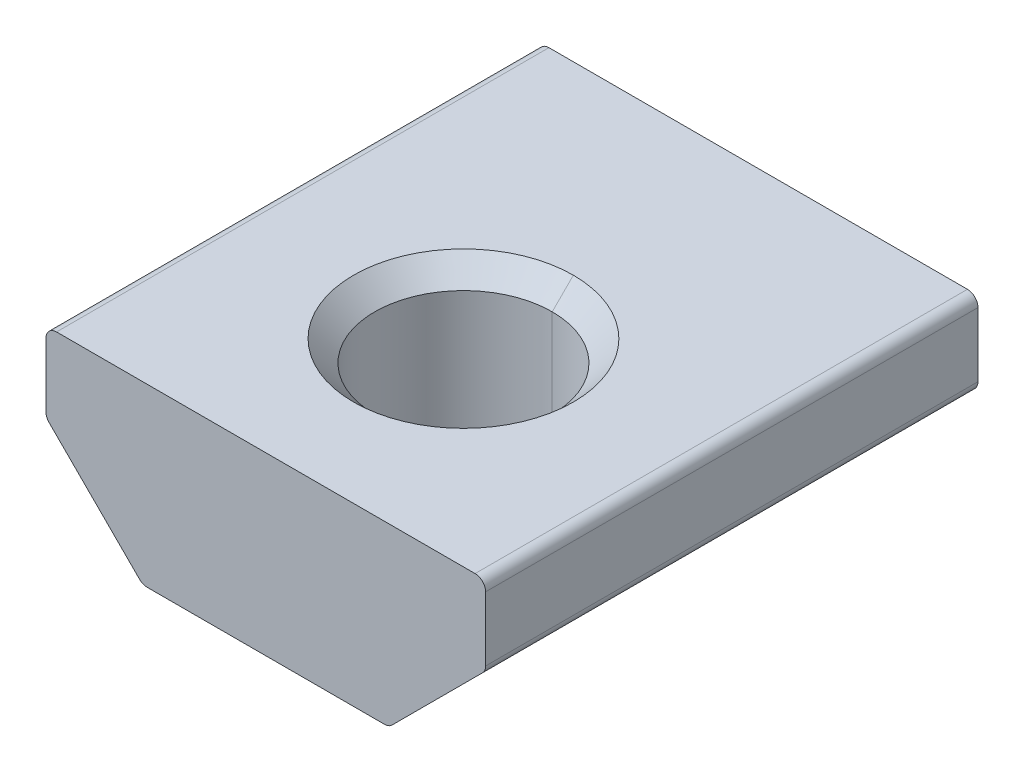
ISO-10303-21;
HEADER;
FILE_DESCRIPTION(('STEP AP214'),'2;1');
FILE_NAME('part.step','',(''),(''),'','','');
FILE_SCHEMA(('AUTOMOTIVE_DESIGN { 1 0 10303 214 1 1 1 1 }'));
ENDSEC;
DATA;
#1=APPLICATION_CONTEXT('core data for automotive mechanical design processes');
#2=APPLICATION_PROTOCOL_DEFINITION('international standard','automotive_design',2000,#1);
#3=PRODUCT_CONTEXT('',#1,'mechanical');
#4=PRODUCT('Part','Part','',(#3));
#5=PRODUCT_RELATED_PRODUCT_CATEGORY('part','',(#4));
#6=PRODUCT_DEFINITION_FORMATION('','',#4);
#7=PRODUCT_DEFINITION_CONTEXT('part definition',#1,'design');
#8=PRODUCT_DEFINITION('design','',#6,#7);
#9=PRODUCT_DEFINITION_SHAPE('','',#8);
#10=(LENGTH_UNIT() NAMED_UNIT(*) SI_UNIT(.MILLI.,.METRE.));
#11=(NAMED_UNIT(*) PLANE_ANGLE_UNIT() SI_UNIT($,.RADIAN.));
#12=(NAMED_UNIT(*) SI_UNIT($,.STERADIAN.) SOLID_ANGLE_UNIT());
#13=UNCERTAINTY_MEASURE_WITH_UNIT(LENGTH_MEASURE(1.E-05),#10,'distance_accuracy_value','');
#14=(GEOMETRIC_REPRESENTATION_CONTEXT(3) GLOBAL_UNCERTAINTY_ASSIGNED_CONTEXT((#13)) GLOBAL_UNIT_ASSIGNED_CONTEXT((#10,
#11,#12)) REPRESENTATION_CONTEXT('',''));
#15=CARTESIAN_POINT('',(0.,0.,0.));
#16=DIRECTION('',(0.,0.,1.));
#17=DIRECTION('',(1.,0.,0.));
#18=AXIS2_PLACEMENT_3D('',#15,#16,#17);
#19=CARTESIAN_POINT('',(-7.55650000000015,5.96900000000015,7.1374));
#20=DIRECTION('',(0.,0.,-1.));
#21=DIRECTION('',(0.707106781186548,-0.707106781186547,0.));
#22=AXIS2_PLACEMENT_3D('',#19,#20,#21);
#23=CYLINDRICAL_SURFACE('',#22,0.380999999999846);
#24=CARTESIAN_POINT('',(-7.55650000000015,5.96900000000015,-10.6426));
#25=DIRECTION('',(0.,0.,1.));
#26=DIRECTION('',(1.,0.,0.));
#27=AXIS2_PLACEMENT_3D('',#24,#25,#26);
#28=CIRCLE('',#27,0.380999999999846);
#29=CARTESIAN_POINT('',(-7.5565,6.35,-10.6426));
#30=VERTEX_POINT('',#29);
#31=CARTESIAN_POINT('',(-7.9375,5.969,-10.6426));
#32=VERTEX_POINT('',#31);
#33=EDGE_CURVE('E11',#30,#32,#28,.T.);
#34=ORIENTED_EDGE('',*,*,#33,.T.);
#35=DIRECTION('',(0.,0.,-1.));
#36=VECTOR('',#35,1.);
#37=CARTESIAN_POINT('',(-7.9375,5.969,7.1374));
#38=LINE('',#37,#36);
#39=CARTESIAN_POINT('',(-7.9375,5.969,7.1374));
#40=VERTEX_POINT('',#39);
#41=EDGE_CURVE('E25',#40,#32,#38,.T.);
#42=ORIENTED_EDGE('',*,*,#41,.F.);
#43=CARTESIAN_POINT('',(-7.55650000000015,5.96900000000015,7.1374));
#44=DIRECTION('',(0.,0.,1.));
#45=DIRECTION('',(1.,0.,0.));
#46=AXIS2_PLACEMENT_3D('',#43,#44,#45);
#47=CIRCLE('',#46,0.380999999999846);
#48=CARTESIAN_POINT('',(-7.5565,6.35,7.1374));
#49=VERTEX_POINT('',#48);
#50=EDGE_CURVE('E374',#49,#40,#47,.T.);
#51=ORIENTED_EDGE('',*,*,#50,.F.);
#52=DIRECTION('',(0.,0.,-1.));
#53=VECTOR('',#52,1.);
#54=CARTESIAN_POINT('',(-7.5565,6.35,7.1374));
#55=LINE('',#54,#53);
#56=EDGE_CURVE('E370',#49,#30,#55,.T.);
#57=ORIENTED_EDGE('',*,*,#56,.T.);
#58=EDGE_LOOP('',(#34,#42,#51,#57));
#59=FACE_BOUND('',#58,.T.);
#60=ADVANCED_FACE('F17',(#59),#23,.T.);
#61=CARTESIAN_POINT('',(7.5565,6.35,7.1374));
#62=DIRECTION('',(0.,-1.,0.));
#63=DIRECTION('',(0.,0.,-1.));
#64=AXIS2_PLACEMENT_3D('',#61,#62,#63);
#65=PLANE('',#64);
#66=CARTESIAN_POINT('',(0.,6.35,0.));
#67=DIRECTION('',(0.,-1.,0.));
#68=DIRECTION('',(0.,0.,-1.));
#69=AXIS2_PLACEMENT_3D('',#66,#67,#68);
#70=CIRCLE('',#69,3.96875);
#71=CARTESIAN_POINT('',(0.,6.35,-3.96875));
#72=VERTEX_POINT('',#71);
#73=CARTESIAN_POINT('',(0.,6.35,3.96875));
#74=VERTEX_POINT('',#73);
#75=EDGE_CURVE('E161',#72,#74,#70,.T.);
#76=ORIENTED_EDGE('',*,*,#75,.T.);
#77=CARTESIAN_POINT('',(0.,6.35,0.));
#78=DIRECTION('',(0.,-1.,0.));
#79=DIRECTION('',(0.,0.,-1.));
#80=AXIS2_PLACEMENT_3D('',#77,#78,#79);
#81=CIRCLE('',#80,3.96875);
#82=EDGE_CURVE('E363',#74,#72,#81,.T.);
#83=ORIENTED_EDGE('',*,*,#82,.T.);
#84=EDGE_LOOP('',(#76,#83));
#85=FACE_BOUND('',#84,.T.);
#86=DIRECTION('',(-1.,0.,0.));
#87=VECTOR('',#86,1.);
#88=CARTESIAN_POINT('',(7.5565,6.35,-10.6426));
#89=LINE('',#88,#87);
#90=CARTESIAN_POINT('',(7.5565,6.35,-10.6426));
#91=VERTEX_POINT('',#90);
#92=EDGE_CURVE('E358',#91,#30,#89,.T.);
#93=ORIENTED_EDGE('',*,*,#92,.T.);
#94=ORIENTED_EDGE('',*,*,#56,.F.);
#95=DIRECTION('',(-1.,0.,0.));
#96=VECTOR('',#95,1.);
#97=CARTESIAN_POINT('',(7.5565,6.35,7.1374));
#98=LINE('',#97,#96);
#99=CARTESIAN_POINT('',(7.5565,6.35,7.1374));
#100=VERTEX_POINT('',#99);
#101=EDGE_CURVE('E353',#100,#49,#98,.T.);
#102=ORIENTED_EDGE('',*,*,#101,.F.);
#103=DIRECTION('',(0.,0.,-1.));
#104=VECTOR('',#103,1.);
#105=CARTESIAN_POINT('',(7.5565,6.35,7.1374));
#106=LINE('',#105,#104);
#107=EDGE_CURVE('E349',#100,#91,#106,.T.);
#108=ORIENTED_EDGE('',*,*,#107,.T.);
#109=EDGE_LOOP('',(#93,#94,#102,#108));
#110=FACE_BOUND('',#109,.T.);
#111=ADVANCED_FACE('F391',(#85,#110),#65,.F.);
#112=CARTESIAN_POINT('',(7.55650000000015,5.96900000000015,7.1374));
#113=DIRECTION('',(0.,0.,-1.));
#114=DIRECTION('',(-0.707106781186547,-0.707106781186548,0.));
#115=AXIS2_PLACEMENT_3D('',#112,#113,#114);
#116=CYLINDRICAL_SURFACE('',#115,0.380999999999847);
#117=CARTESIAN_POINT('',(7.55650000000015,5.96900000000015,-10.6426));
#118=DIRECTION('',(0.,0.,1.));
#119=DIRECTION('',(1.,0.,0.));
#120=AXIS2_PLACEMENT_3D('',#117,#118,#119);
#121=CIRCLE('',#120,0.380999999999847);
#122=CARTESIAN_POINT('',(7.9375,5.969,-10.6426));
#123=VERTEX_POINT('',#122);
#124=EDGE_CURVE('E344',#123,#91,#121,.T.);
#125=ORIENTED_EDGE('',*,*,#124,.T.);
#126=ORIENTED_EDGE('',*,*,#107,.F.);
#127=CARTESIAN_POINT('',(7.55650000000015,5.96900000000015,7.1374));
#128=DIRECTION('',(0.,0.,1.));
#129=DIRECTION('',(1.,0.,0.));
#130=AXIS2_PLACEMENT_3D('',#127,#128,#129);
#131=CIRCLE('',#130,0.380999999999847);
#132=CARTESIAN_POINT('',(7.9375,5.969,7.1374));
#133=VERTEX_POINT('',#132);
#134=EDGE_CURVE('E339',#133,#100,#131,.T.);
#135=ORIENTED_EDGE('',*,*,#134,.F.);
#136=DIRECTION('',(0.,0.,-1.));
#137=VECTOR('',#136,1.);
#138=CARTESIAN_POINT('',(7.9375,5.969,7.1374));
#139=LINE('',#138,#137);
#140=EDGE_CURVE('E335',#133,#123,#139,.T.);
#141=ORIENTED_EDGE('',*,*,#140,.T.);
#142=EDGE_LOOP('',(#125,#126,#135,#141));
#143=FACE_BOUND('',#142,.T.);
#144=ADVANCED_FACE('F429',(#143),#116,.T.);
#145=CARTESIAN_POINT('',(7.9375,3.65031536726424,7.1374));
#146=DIRECTION('',(-1.,0.,0.));
#147=DIRECTION('',(0.,0.,1.));
#148=AXIS2_PLACEMENT_3D('',#145,#146,#147);
#149=PLANE('',#148);
#150=DIRECTION('',(0.,1.,0.));
#151=VECTOR('',#150,1.);
#152=CARTESIAN_POINT('',(7.9375,3.65031536726424,-10.6426));
#153=LINE('',#152,#151);
#154=CARTESIAN_POINT('',(7.9375,3.65031536726424,-10.6426));
#155=VERTEX_POINT('',#154);
#156=EDGE_CURVE('E330',#155,#123,#153,.T.);
#157=ORIENTED_EDGE('',*,*,#156,.T.);
#158=ORIENTED_EDGE('',*,*,#140,.F.);
#159=DIRECTION('',(0.,1.,0.));
#160=VECTOR('',#159,1.);
#161=CARTESIAN_POINT('',(7.9375,3.65031536726424,7.1374));
#162=LINE('',#161,#160);
#163=CARTESIAN_POINT('',(7.9375,3.65031536726424,7.1374));
#164=VERTEX_POINT('',#163);
#165=EDGE_CURVE('E325',#164,#133,#162,.T.);
#166=ORIENTED_EDGE('',*,*,#165,.F.);
#167=DIRECTION('',(0.,0.,-1.));
#168=VECTOR('',#167,1.);
#169=CARTESIAN_POINT('',(7.9375,3.65031536726424,7.1374));
#170=LINE('',#169,#168);
#171=EDGE_CURVE('E321',#164,#155,#170,.T.);
#172=ORIENTED_EDGE('',*,*,#171,.T.);
#173=EDGE_LOOP('',(#157,#158,#166,#172));
#174=FACE_BOUND('',#173,.T.);
#175=ADVANCED_FACE('F427',(#174),#149,.F.);
#176=CARTESIAN_POINT('',(7.5565000000002,3.65031536726407,7.1374));
#177=DIRECTION('',(0.,0.,-1.));
#178=DIRECTION('',(-0.923879532511361,0.38268343236491,0.));
#179=AXIS2_PLACEMENT_3D('',#176,#177,#178);
#180=CYLINDRICAL_SURFACE('',#179,0.380999999999805);
#181=CARTESIAN_POINT('',(7.5565000000002,3.65031536726407,-10.6426));
#182=DIRECTION('',(0.,0.,1.));
#183=DIRECTION('',(1.,0.,0.));
#184=AXIS2_PLACEMENT_3D('',#181,#182,#183);
#185=CIRCLE('',#184,0.380999999999805);
#186=CARTESIAN_POINT('',(7.82590768363212,3.38090768363212,-10.6426));
#187=VERTEX_POINT('',#186);
#188=EDGE_CURVE('E316',#187,#155,#185,.T.);
#189=ORIENTED_EDGE('',*,*,#188,.T.);
#190=ORIENTED_EDGE('',*,*,#171,.F.);
#191=CARTESIAN_POINT('',(7.5565000000002,3.65031536726407,7.1374));
#192=DIRECTION('',(0.,0.,1.));
#193=DIRECTION('',(1.,0.,0.));
#194=AXIS2_PLACEMENT_3D('',#191,#192,#193);
#195=CIRCLE('',#194,0.380999999999805);
#196=CARTESIAN_POINT('',(7.82590768363212,3.38090768363212,7.1374));
#197=VERTEX_POINT('',#196);
#198=EDGE_CURVE('E311',#197,#164,#195,.T.);
#199=ORIENTED_EDGE('',*,*,#198,.F.);
#200=DIRECTION('',(0.,0.,-1.));
#201=VECTOR('',#200,1.);
#202=CARTESIAN_POINT('',(7.82590768363212,3.38090768363212,7.1374));
#203=LINE('',#202,#201);
#204=EDGE_CURVE('E307',#197,#187,#203,.T.);
#205=ORIENTED_EDGE('',*,*,#204,.T.);
#206=EDGE_LOOP('',(#189,#190,#199,#205));
#207=FACE_BOUND('',#206,.T.);
#208=ADVANCED_FACE('F422',(#207),#180,.T.);
#209=CARTESIAN_POINT('',(4.55659231636788,0.111592316367926,7.1374));
#210=DIRECTION('',(-0.707106781186543,0.707106781186553,0.));
#211=DIRECTION('',(-0.707106781186553,-0.707106781186543,0.));
#212=AXIS2_PLACEMENT_3D('',#209,#210,#211);
#213=PLANE('',#212);
#214=DIRECTION('',(0.707106781186553,0.707106781186543,0.));
#215=VECTOR('',#214,1.);
#216=CARTESIAN_POINT('',(4.55659231636788,0.111592316367926,-10.6426));
#217=LINE('',#216,#215);
#218=CARTESIAN_POINT('',(4.55659231636788,0.111592316367925,-10.6426));
#219=VERTEX_POINT('',#218);
#220=EDGE_CURVE('E302',#219,#187,#217,.T.);
#221=ORIENTED_EDGE('',*,*,#220,.T.);
#222=ORIENTED_EDGE('',*,*,#204,.F.);
#223=DIRECTION('',(0.707106781186553,0.707106781186543,0.));
#224=VECTOR('',#223,1.);
#225=CARTESIAN_POINT('',(4.55659231636788,0.111592316367926,7.1374));
#226=LINE('',#225,#224);
#227=CARTESIAN_POINT('',(4.55659231636788,0.111592316367925,7.1374));
#228=VERTEX_POINT('',#227);
#229=EDGE_CURVE('E297',#228,#197,#226,.T.);
#230=ORIENTED_EDGE('',*,*,#229,.F.);
#231=DIRECTION('',(0.,0.,-1.));
#232=VECTOR('',#231,1.);
#233=CARTESIAN_POINT('',(4.55659231636788,0.111592316367925,7.1374));
#234=LINE('',#233,#232);
#235=EDGE_CURVE('E293',#228,#219,#234,.T.);
#236=ORIENTED_EDGE('',*,*,#235,.T.);
#237=EDGE_LOOP('',(#221,#222,#230,#236));
#238=FACE_BOUND('',#237,.T.);
#239=ADVANCED_FACE('F419',(#238),#213,.F.);
#240=CARTESIAN_POINT('',(4.2871846327359,0.380999999999779,7.1374));
#241=DIRECTION('',(0.,0.,-1.));
#242=DIRECTION('',(-0.382683432365037,0.923879532511309,0.));
#243=AXIS2_PLACEMENT_3D('',#240,#241,#242);
#244=CYLINDRICAL_SURFACE('',#243,0.380999999999779);
#245=CARTESIAN_POINT('',(4.2871846327359,0.380999999999779,-10.6426));
#246=DIRECTION('',(0.,0.,1.));
#247=DIRECTION('',(1.,0.,0.));
#248=AXIS2_PLACEMENT_3D('',#245,#246,#247);
#249=CIRCLE('',#248,0.380999999999779);
#250=CARTESIAN_POINT('',(4.28718463273576,0.,-10.6426));
#251=VERTEX_POINT('',#250);
#252=EDGE_CURVE('E288',#251,#219,#249,.T.);
#253=ORIENTED_EDGE('',*,*,#252,.T.);
#254=ORIENTED_EDGE('',*,*,#235,.F.);
#255=CARTESIAN_POINT('',(4.2871846327359,0.380999999999779,7.1374));
#256=DIRECTION('',(0.,0.,1.));
#257=DIRECTION('',(1.,0.,0.));
#258=AXIS2_PLACEMENT_3D('',#255,#256,#257);
#259=CIRCLE('',#258,0.380999999999779);
#260=CARTESIAN_POINT('',(4.28718463273576,0.,7.1374));
#261=VERTEX_POINT('',#260);
#262=EDGE_CURVE('E283',#261,#228,#259,.T.);
#263=ORIENTED_EDGE('',*,*,#262,.F.);
#264=DIRECTION('',(0.,0.,-1.));
#265=VECTOR('',#264,1.);
#266=CARTESIAN_POINT('',(4.28718463273576,0.,7.1374));
#267=LINE('',#266,#265);
#268=EDGE_CURVE('E279',#261,#251,#267,.T.);
#269=ORIENTED_EDGE('',*,*,#268,.T.);
#270=EDGE_LOOP('',(#253,#254,#263,#269));
#271=FACE_BOUND('',#270,.T.);
#272=ADVANCED_FACE('F416',(#271),#244,.T.);
#273=CARTESIAN_POINT('',(-4.28718463273576,0.,7.1374));
#274=DIRECTION('',(0.,1.,0.));
#275=DIRECTION('',(0.,0.,1.));
#276=AXIS2_PLACEMENT_3D('',#273,#274,#275);
#277=PLANE('',#276);
#278=CARTESIAN_POINT('',(0.,0.,0.));
#279=DIRECTION('',(0.,-1.,0.));
#280=DIRECTION('',(0.,0.,-1.));
#281=AXIS2_PLACEMENT_3D('',#278,#279,#280);
#282=CIRCLE('',#281,3.96875);
#283=CARTESIAN_POINT('',(0.,0.,3.96875));
#284=VERTEX_POINT('',#283);
#285=CARTESIAN_POINT('',(0.,0.,-3.96875));
#286=VERTEX_POINT('',#285);
#287=EDGE_CURVE('E274',#284,#286,#282,.T.);
#288=ORIENTED_EDGE('',*,*,#287,.F.);
#289=CARTESIAN_POINT('',(0.,0.,0.));
#290=DIRECTION('',(0.,-1.,0.));
#291=DIRECTION('',(0.,0.,-1.));
#292=AXIS2_PLACEMENT_3D('',#289,#290,#291);
#293=CIRCLE('',#292,3.96875);
#294=EDGE_CURVE('E269',#286,#284,#293,.T.);
#295=ORIENTED_EDGE('',*,*,#294,.F.);
#296=EDGE_LOOP('',(#288,#295));
#297=FACE_BOUND('',#296,.T.);
#298=DIRECTION('',(1.,0.,0.));
#299=VECTOR('',#298,1.);
#300=CARTESIAN_POINT('',(-4.28718463273576,0.,-10.6426));
#301=LINE('',#300,#299);
#302=CARTESIAN_POINT('',(-4.28718463273576,0.,-10.6426));
#303=VERTEX_POINT('',#302);
#304=EDGE_CURVE('E264',#303,#251,#301,.T.);
#305=ORIENTED_EDGE('',*,*,#304,.T.);
#306=ORIENTED_EDGE('',*,*,#268,.F.);
#307=DIRECTION('',(1.,0.,0.));
#308=VECTOR('',#307,1.);
#309=CARTESIAN_POINT('',(-4.28718463273576,0.,7.1374));
#310=LINE('',#309,#308);
#311=CARTESIAN_POINT('',(-4.28718463273576,0.,7.1374));
#312=VERTEX_POINT('',#311);
#313=EDGE_CURVE('E259',#312,#261,#310,.T.);
#314=ORIENTED_EDGE('',*,*,#313,.F.);
#315=DIRECTION('',(0.,0.,-1.));
#316=VECTOR('',#315,1.);
#317=CARTESIAN_POINT('',(-4.28718463273576,0.,7.1374));
#318=LINE('',#317,#316);
#319=EDGE_CURVE('E255',#312,#303,#318,.T.);
#320=ORIENTED_EDGE('',*,*,#319,.T.);
#321=EDGE_LOOP('',(#305,#306,#314,#320));
#322=FACE_BOUND('',#321,.T.);
#323=ADVANCED_FACE('F410',(#297,#322),#277,.F.);
#324=CARTESIAN_POINT('',(-4.2871846327359,0.380999999999779,7.1374));
#325=DIRECTION('',(0.,0.,-1.));
#326=DIRECTION('',(0.382683432365037,0.923879532511309,0.));
#327=AXIS2_PLACEMENT_3D('',#324,#325,#326);
#328=CYLINDRICAL_SURFACE('',#327,0.380999999999779);
#329=CARTESIAN_POINT('',(-4.2871846327359,0.380999999999779,-10.6426));
#330=DIRECTION('',(0.,0.,1.));
#331=DIRECTION('',(1.,0.,0.));
#332=AXIS2_PLACEMENT_3D('',#329,#330,#331);
#333=CIRCLE('',#332,0.380999999999779);
#334=CARTESIAN_POINT('',(-4.55659231636788,0.111592316367926,-10.6426));
#335=VERTEX_POINT('',#334);
#336=EDGE_CURVE('E250',#335,#303,#333,.T.);
#337=ORIENTED_EDGE('',*,*,#336,.T.);
#338=ORIENTED_EDGE('',*,*,#319,.F.);
#339=CARTESIAN_POINT('',(-4.2871846327359,0.380999999999779,7.1374));
#340=DIRECTION('',(0.,0.,1.));
#341=DIRECTION('',(1.,0.,0.));
#342=AXIS2_PLACEMENT_3D('',#339,#340,#341);
#343=CIRCLE('',#342,0.380999999999779);
#344=CARTESIAN_POINT('',(-4.55659231636788,0.111592316367926,7.1374));
#345=VERTEX_POINT('',#344);
#346=EDGE_CURVE('E245',#345,#312,#343,.T.);
#347=ORIENTED_EDGE('',*,*,#346,.F.);
#348=DIRECTION('',(0.,0.,-1.));
#349=VECTOR('',#348,1.);
#350=CARTESIAN_POINT('',(-4.55659231636788,0.111592316367926,7.1374));
#351=LINE('',#350,#349);
#352=EDGE_CURVE('E241',#345,#335,#351,.T.);
#353=ORIENTED_EDGE('',*,*,#352,.T.);
#354=EDGE_LOOP('',(#337,#338,#347,#353));
#355=FACE_BOUND('',#354,.T.);
#356=ADVANCED_FACE('F407',(#355),#328,.T.);
#357=CARTESIAN_POINT('',(-7.82590768363212,3.38090768363212,7.1374));
#358=DIRECTION('',(0.707106781186543,0.707106781186553,0.));
#359=DIRECTION('',(-0.707106781186553,0.707106781186543,0.));
#360=AXIS2_PLACEMENT_3D('',#357,#358,#359);
#361=PLANE('',#360);
#362=DIRECTION('',(0.707106781186553,-0.707106781186543,0.));
#363=VECTOR('',#362,1.);
#364=CARTESIAN_POINT('',(-7.82590768363212,3.38090768363212,-10.6426));
#365=LINE('',#364,#363);
#366=CARTESIAN_POINT('',(-7.82590768363212,3.38090768363212,-10.6426));
#367=VERTEX_POINT('',#366);
#368=EDGE_CURVE('E236',#367,#335,#365,.T.);
#369=ORIENTED_EDGE('',*,*,#368,.T.);
#370=ORIENTED_EDGE('',*,*,#352,.F.);
#371=DIRECTION('',(0.707106781186553,-0.707106781186543,0.));
#372=VECTOR('',#371,1.);
#373=CARTESIAN_POINT('',(-7.82590768363212,3.38090768363212,7.1374));
#374=LINE('',#373,#372);
#375=CARTESIAN_POINT('',(-7.82590768363212,3.38090768363212,7.1374));
#376=VERTEX_POINT('',#375);
#377=EDGE_CURVE('E231',#376,#345,#374,.T.);
#378=ORIENTED_EDGE('',*,*,#377,.F.);
#379=DIRECTION('',(0.,0.,-1.));
#380=VECTOR('',#379,1.);
#381=CARTESIAN_POINT('',(-7.82590768363212,3.38090768363212,7.1374));
#382=LINE('',#381,#380);
#383=EDGE_CURVE('E227',#376,#367,#382,.T.);
#384=ORIENTED_EDGE('',*,*,#383,.T.);
#385=EDGE_LOOP('',(#369,#370,#378,#384));
#386=FACE_BOUND('',#385,.T.);
#387=ADVANCED_FACE('F405',(#386),#361,.F.);
#388=CARTESIAN_POINT('',(-7.5565000000002,3.65031536726407,7.1374));
#389=DIRECTION('',(0.,0.,-1.));
#390=DIRECTION('',(0.923879532511361,0.382683432364911,0.));
#391=AXIS2_PLACEMENT_3D('',#388,#389,#390);
#392=CYLINDRICAL_SURFACE('',#391,0.380999999999805);
#393=CARTESIAN_POINT('',(-7.5565000000002,3.65031536726407,-10.6426));
#394=DIRECTION('',(0.,0.,1.));
#395=DIRECTION('',(1.,0.,0.));
#396=AXIS2_PLACEMENT_3D('',#393,#394,#395);
#397=CIRCLE('',#396,0.380999999999805);
#398=CARTESIAN_POINT('',(-7.9375,3.65031536726424,-10.6426));
#399=VERTEX_POINT('',#398);
#400=EDGE_CURVE('E222',#399,#367,#397,.T.);
#401=ORIENTED_EDGE('',*,*,#400,.T.);
#402=ORIENTED_EDGE('',*,*,#383,.F.);
#403=CARTESIAN_POINT('',(-7.5565000000002,3.65031536726407,7.1374));
#404=DIRECTION('',(0.,0.,1.));
#405=DIRECTION('',(1.,0.,0.));
#406=AXIS2_PLACEMENT_3D('',#403,#404,#405);
#407=CIRCLE('',#406,0.380999999999805);
#408=CARTESIAN_POINT('',(-7.9375,3.65031536726424,7.1374));
#409=VERTEX_POINT('',#408);
#410=EDGE_CURVE('E217',#409,#376,#407,.T.);
#411=ORIENTED_EDGE('',*,*,#410,.F.);
#412=DIRECTION('',(0.,0.,-1.));
#413=VECTOR('',#412,1.);
#414=CARTESIAN_POINT('',(-7.9375,3.65031536726424,7.1374));
#415=LINE('',#414,#413);
#416=EDGE_CURVE('E213',#409,#399,#415,.T.);
#417=ORIENTED_EDGE('',*,*,#416,.T.);
#418=EDGE_LOOP('',(#401,#402,#411,#417));
#419=FACE_BOUND('',#418,.T.);
#420=ADVANCED_FACE('F401',(#419),#392,.T.);
#421=CARTESIAN_POINT('',(-7.9375,5.969,7.1374));
#422=DIRECTION('',(1.,0.,0.));
#423=DIRECTION('',(0.,0.,-1.));
#424=AXIS2_PLACEMENT_3D('',#421,#422,#423);
#425=PLANE('',#424);
#426=DIRECTION('',(0.,-1.,0.));
#427=VECTOR('',#426,1.);
#428=CARTESIAN_POINT('',(-7.9375,5.969,-10.6426));
#429=LINE('',#428,#427);
#430=EDGE_CURVE('E208',#32,#399,#429,.T.);
#431=ORIENTED_EDGE('',*,*,#430,.T.);
#432=ORIENTED_EDGE('',*,*,#416,.F.);
#433=DIRECTION('',(0.,-1.,0.));
#434=VECTOR('',#433,1.);
#435=CARTESIAN_POINT('',(-7.9375,5.969,7.1374));
#436=LINE('',#435,#434);
#437=EDGE_CURVE('E203',#40,#409,#436,.T.);
#438=ORIENTED_EDGE('',*,*,#437,.F.);
#439=ORIENTED_EDGE('',*,*,#41,.T.);
#440=EDGE_LOOP('',(#431,#432,#438,#439));
#441=FACE_BOUND('',#440,.T.);
#442=ADVANCED_FACE('F384',(#441),#425,.F.);
#443=CARTESIAN_POINT('',(-7.55650000000015,5.96900000000015,7.1374));
#444=DIRECTION('',(0.,0.,1.));
#445=DIRECTION('',(1.,0.,0.));
#446=AXIS2_PLACEMENT_3D('',#443,#444,#445);
#447=PLANE('',#446);
#448=ORIENTED_EDGE('',*,*,#50,.T.);
#449=ORIENTED_EDGE('',*,*,#437,.T.);
#450=ORIENTED_EDGE('',*,*,#410,.T.);
#451=ORIENTED_EDGE('',*,*,#377,.T.);
#452=ORIENTED_EDGE('',*,*,#346,.T.);
#453=ORIENTED_EDGE('',*,*,#313,.T.);
#454=ORIENTED_EDGE('',*,*,#262,.T.);
#455=ORIENTED_EDGE('',*,*,#229,.T.);
#456=ORIENTED_EDGE('',*,*,#198,.T.);
#457=ORIENTED_EDGE('',*,*,#165,.T.);
#458=ORIENTED_EDGE('',*,*,#134,.T.);
#459=ORIENTED_EDGE('',*,*,#101,.T.);
#460=EDGE_LOOP('',(#448,#449,#450,#451,#452,#453,#454,#455,#456,#457,#458,#459));
#461=FACE_BOUND('',#460,.T.);
#462=ADVANCED_FACE('F388',(#461),#447,.T.);
#463=CARTESIAN_POINT('',(-7.55650000000015,5.96900000000015,-10.6426));
#464=DIRECTION('',(0.,0.,1.));
#465=DIRECTION('',(1.,0.,0.));
#466=AXIS2_PLACEMENT_3D('',#463,#464,#465);
#467=PLANE('',#466);
#468=ORIENTED_EDGE('',*,*,#33,.F.);
#469=ORIENTED_EDGE('',*,*,#92,.F.);
#470=ORIENTED_EDGE('',*,*,#124,.F.);
#471=ORIENTED_EDGE('',*,*,#156,.F.);
#472=ORIENTED_EDGE('',*,*,#188,.F.);
#473=ORIENTED_EDGE('',*,*,#220,.F.);
#474=ORIENTED_EDGE('',*,*,#252,.F.);
#475=ORIENTED_EDGE('',*,*,#304,.F.);
#476=ORIENTED_EDGE('',*,*,#336,.F.);
#477=ORIENTED_EDGE('',*,*,#368,.F.);
#478=ORIENTED_EDGE('',*,*,#400,.F.);
#479=ORIENTED_EDGE('',*,*,#430,.F.);
#480=EDGE_LOOP('',(#468,#469,#470,#471,#472,#473,#474,#475,#476,#477,#478,#479));
#481=FACE_BOUND('',#480,.T.);
#482=ADVANCED_FACE('F396',(#481),#467,.F.);
#483=CARTESIAN_POINT('',(0.,0.76327,0.));
#484=DIRECTION('',(0.,-1.,0.));
#485=DIRECTION('',(-1.,0.,0.));
#486=AXIS2_PLACEMENT_3D('',#483,#484,#485);
#487=CONICAL_SURFACE('',#486,3.20548,0.785398163397448);
#488=DIRECTION('',(0.,-0.707106781186547,0.707106781186548));
#489=VECTOR('',#488,1.);
#490=CARTESIAN_POINT('',(0.,0.76327,3.20548));
#491=LINE('',#490,#489);
#492=CARTESIAN_POINT('',(0.,0.76327,3.20548));
#493=VERTEX_POINT('',#492);
#494=EDGE_CURVE('E198',#493,#284,#491,.T.);
#495=ORIENTED_EDGE('',*,*,#494,.F.);
#496=CARTESIAN_POINT('',(0.,0.76327,0.));
#497=DIRECTION('',(0.,-1.,0.));
#498=DIRECTION('',(0.,0.,-1.));
#499=AXIS2_PLACEMENT_3D('',#496,#497,#498);
#500=CIRCLE('',#499,3.20548);
#501=CARTESIAN_POINT('',(0.,0.76327,-3.20548));
#502=VERTEX_POINT('',#501);
#503=EDGE_CURVE('E194',#502,#493,#500,.T.);
#504=ORIENTED_EDGE('',*,*,#503,.F.);
#505=DIRECTION('',(0.,-0.707106781186547,-0.707106781186548));
#506=VECTOR('',#505,1.);
#507=CARTESIAN_POINT('',(0.,0.76327,-3.20548));
#508=LINE('',#507,#506);
#509=EDGE_CURVE('E189',#502,#286,#508,.T.);
#510=ORIENTED_EDGE('',*,*,#509,.T.);
#511=ORIENTED_EDGE('',*,*,#294,.T.);
#512=EDGE_LOOP('',(#495,#504,#510,#511));
#513=FACE_BOUND('',#512,.T.);
#514=ADVANCED_FACE('F555',(#513),#487,.F.);
#515=CARTESIAN_POINT('',(0.,0.76327,0.));
#516=DIRECTION('',(0.,-1.,0.));
#517=DIRECTION('',(1.,0.,0.));
#518=AXIS2_PLACEMENT_3D('',#515,#516,#517);
#519=CONICAL_SURFACE('',#518,3.20548,0.785398163397448);
#520=ORIENTED_EDGE('',*,*,#494,.T.);
#521=ORIENTED_EDGE('',*,*,#287,.T.);
#522=ORIENTED_EDGE('',*,*,#509,.F.);
#523=CARTESIAN_POINT('',(0.,0.76327,0.));
#524=DIRECTION('',(0.,-1.,0.));
#525=DIRECTION('',(0.,0.,-1.));
#526=AXIS2_PLACEMENT_3D('',#523,#524,#525);
#527=CIRCLE('',#526,3.20548);
#528=CARTESIAN_POINT('',(-0.990547795129006,0.76327,3.04859264185379));
#529=VERTEX_POINT('',#528);
#530=EDGE_CURVE('E151',#529,#502,#527,.T.);
#531=ORIENTED_EDGE('',*,*,#530,.F.);
#532=CARTESIAN_POINT('',(0.,0.76327,0.));
#533=DIRECTION('',(0.,-1.,0.));
#534=DIRECTION('',(0.,0.,-1.));
#535=AXIS2_PLACEMENT_3D('',#532,#533,#534);
#536=CIRCLE('',#535,3.20548);
#537=EDGE_CURVE('E181',#493,#529,#536,.T.);
#538=ORIENTED_EDGE('',*,*,#537,.F.);
#539=EDGE_LOOP('',(#520,#521,#522,#531,#538));
#540=FACE_BOUND('',#539,.T.);
#541=ADVANCED_FACE('F565',(#540),#519,.F.);
#542=CARTESIAN_POINT('',(0.,0.,0.));
#543=DIRECTION('',(0.,-1.,0.));
#544=DIRECTION('',(-0.987688340595138,0.,-0.156434465040231));
#545=AXIS2_PLACEMENT_3D('',#542,#543,#544);
#546=CYLINDRICAL_SURFACE('',#545,3.20548);
#547=DIRECTION('',(0.,-1.,0.));
#548=VECTOR('',#547,1.);
#549=CARTESIAN_POINT('',(-0.990547795129006,5.58673,3.04859264185379));
#550=LINE('',#549,#548);
#551=CARTESIAN_POINT('',(-0.990547795129006,5.58673,3.04859264185379));
#552=VERTEX_POINT('',#551);
#553=EDGE_CURVE('E177',#552,#529,#550,.T.);
#554=ORIENTED_EDGE('',*,*,#553,.F.);
#555=CARTESIAN_POINT('',(0.,5.58673,0.));
#556=DIRECTION('',(0.,-1.,0.));
#557=DIRECTION('',(0.,0.,-1.));
#558=AXIS2_PLACEMENT_3D('',#555,#556,#557);
#559=CIRCLE('',#558,3.20548);
#560=CARTESIAN_POINT('',(0.,5.58673,3.20548));
#561=VERTEX_POINT('',#560);
#562=EDGE_CURVE('E138',#561,#552,#559,.T.);
#563=ORIENTED_EDGE('',*,*,#562,.F.);
#564=CARTESIAN_POINT('',(0.,5.58673,0.));
#565=DIRECTION('',(0.,-1.,0.));
#566=DIRECTION('',(0.,0.,-1.));
#567=AXIS2_PLACEMENT_3D('',#564,#565,#566);
#568=CIRCLE('',#567,3.20548);
#569=CARTESIAN_POINT('',(0.,5.58673,-3.20548));
#570=VERTEX_POINT('',#569);
#571=EDGE_CURVE('E132',#570,#561,#568,.T.);
#572=ORIENTED_EDGE('',*,*,#571,.F.);
#573=DIRECTION('',(0.,-1.,0.));
#574=VECTOR('',#573,1.);
#575=CARTESIAN_POINT('',(0.,5.58673,-3.20548));
#576=LINE('',#575,#574);
#577=EDGE_CURVE('E136',#570,#502,#576,.T.);
#578=ORIENTED_EDGE('',*,*,#577,.T.);
#579=ORIENTED_EDGE('',*,*,#503,.T.);
#580=ORIENTED_EDGE('',*,*,#537,.T.);
#581=EDGE_LOOP('',(#554,#563,#572,#578,#579,#580));
#582=FACE_BOUND('',#581,.T.);
#583=ADVANCED_FACE('F134',(#582),#546,.F.);
#584=CARTESIAN_POINT('',(0.,0.,0.));
#585=DIRECTION('',(0.,-1.,0.));
#586=DIRECTION('',(0.987688340595138,0.,0.156434465040231));
#587=AXIS2_PLACEMENT_3D('',#584,#585,#586);
#588=CYLINDRICAL_SURFACE('',#587,3.20548);
#589=ORIENTED_EDGE('',*,*,#553,.T.);
#590=ORIENTED_EDGE('',*,*,#530,.T.);
#591=ORIENTED_EDGE('',*,*,#577,.F.);
#592=CARTESIAN_POINT('',(0.,5.58673,0.));
#593=DIRECTION('',(0.,-1.,0.));
#594=DIRECTION('',(0.,0.,-1.));
#595=AXIS2_PLACEMENT_3D('',#592,#593,#594);
#596=CIRCLE('',#595,3.20548);
#597=EDGE_CURVE('E150',#552,#570,#596,.T.);
#598=ORIENTED_EDGE('',*,*,#597,.F.);
#599=EDGE_LOOP('',(#589,#590,#591,#598));
#600=FACE_BOUND('',#599,.T.);
#601=ADVANCED_FACE('F149',(#600),#588,.F.);
#602=CARTESIAN_POINT('',(0.,6.35,0.));
#603=DIRECTION('',(0.,1.,0.));
#604=DIRECTION('',(1.,0.,0.));
#605=AXIS2_PLACEMENT_3D('',#602,#603,#604);
#606=CONICAL_SURFACE('',#605,3.96875,0.785398163397448);
#607=DIRECTION('',(0.,0.707106781186548,-0.707106781186548));
#608=VECTOR('',#607,1.);
#609=CARTESIAN_POINT('',(0.,5.58673,-3.20548));
#610=LINE('',#609,#608);
#611=EDGE_CURVE('E157',#570,#72,#610,.T.);
#612=ORIENTED_EDGE('',*,*,#611,.T.);
#613=ORIENTED_EDGE('',*,*,#82,.F.);
#614=DIRECTION('',(0.,0.707106781186548,0.707106781186548));
#615=VECTOR('',#614,1.);
#616=CARTESIAN_POINT('',(0.,5.58673,3.20548));
#617=LINE('',#616,#615);
#618=EDGE_CURVE('E162',#561,#74,#617,.T.);
#619=ORIENTED_EDGE('',*,*,#618,.F.);
#620=ORIENTED_EDGE('',*,*,#562,.T.);
#621=ORIENTED_EDGE('',*,*,#597,.T.);
#622=EDGE_LOOP('',(#612,#613,#619,#620,#621));
#623=FACE_BOUND('',#622,.T.);
#624=ADVANCED_FACE('F155',(#623),#606,.F.);
#625=CARTESIAN_POINT('',(0.,6.35,0.));
#626=DIRECTION('',(0.,1.,0.));
#627=DIRECTION('',(-1.,0.,0.));
#628=AXIS2_PLACEMENT_3D('',#625,#626,#627);
#629=CONICAL_SURFACE('',#628,3.96875,0.785398163397448);
#630=ORIENTED_EDGE('',*,*,#611,.F.);
#631=ORIENTED_EDGE('',*,*,#571,.T.);
#632=ORIENTED_EDGE('',*,*,#618,.T.);
#633=ORIENTED_EDGE('',*,*,#75,.F.);
#634=EDGE_LOOP('',(#630,#631,#632,#633));
#635=FACE_BOUND('',#634,.T.);
#636=ADVANCED_FACE('F160',(#635),#629,.F.);
#637=CLOSED_SHELL('',(#60,#111,#144,#175,#208,#239,#272,#323,#356,#387,#420,#442,#462,#482,#514,
#541,#583,#601,#624,#636));
#638=MANIFOLD_SOLID_BREP('B1',#637);
#639=ADVANCED_BREP_SHAPE_REPRESENTATION('',(#18,#638),#14);
#640=SHAPE_DEFINITION_REPRESENTATION(#9,#639);
ENDSEC;
END-ISO-10303-21;
